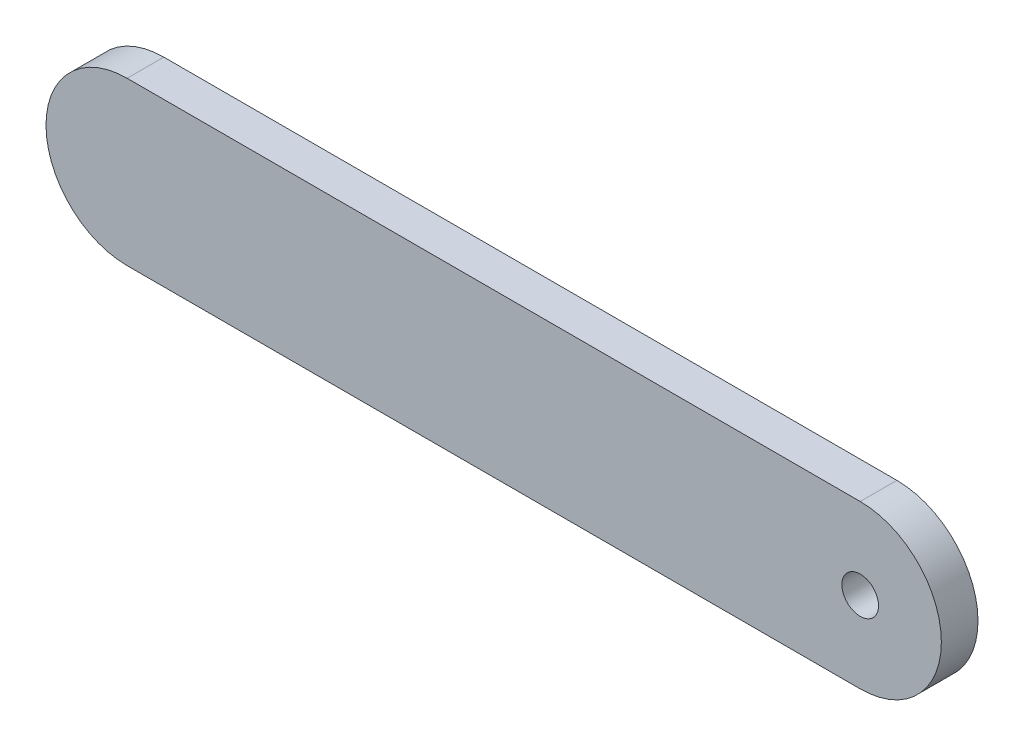
ISO-10303-21;
HEADER;
FILE_DESCRIPTION(('STEP AP214'),'2;1');
FILE_NAME('part.step','',(''),(''),'','','');
FILE_SCHEMA(('AUTOMOTIVE_DESIGN { 1 0 10303 214 1 1 1 1 }'));
ENDSEC;
DATA;
#1=APPLICATION_CONTEXT('core data for automotive mechanical design processes');
#2=APPLICATION_PROTOCOL_DEFINITION('international standard','automotive_design',2000,#1);
#3=PRODUCT_CONTEXT('',#1,'mechanical');
#4=PRODUCT('Part','Part','',(#3));
#5=PRODUCT_RELATED_PRODUCT_CATEGORY('part','',(#4));
#6=PRODUCT_DEFINITION_FORMATION('','',#4);
#7=PRODUCT_DEFINITION_CONTEXT('part definition',#1,'design');
#8=PRODUCT_DEFINITION('design','',#6,#7);
#9=PRODUCT_DEFINITION_SHAPE('','',#8);
#10=(LENGTH_UNIT() NAMED_UNIT(*) SI_UNIT(.MILLI.,.METRE.));
#11=(NAMED_UNIT(*) PLANE_ANGLE_UNIT() SI_UNIT($,.RADIAN.));
#12=(NAMED_UNIT(*) SI_UNIT($,.STERADIAN.) SOLID_ANGLE_UNIT());
#13=UNCERTAINTY_MEASURE_WITH_UNIT(LENGTH_MEASURE(1.E-05),#10,'distance_accuracy_value','');
#14=(GEOMETRIC_REPRESENTATION_CONTEXT(3) GLOBAL_UNCERTAINTY_ASSIGNED_CONTEXT((#13)) GLOBAL_UNIT_ASSIGNED_CONTEXT((#10,
#11,#12)) REPRESENTATION_CONTEXT('',''));
#15=CARTESIAN_POINT('',(0.,0.,0.));
#16=DIRECTION('',(0.,0.,1.));
#17=DIRECTION('',(1.,0.,0.));
#18=AXIS2_PLACEMENT_3D('',#15,#16,#17);
#19=CARTESIAN_POINT('',(-18.3965301196174,0.,3.));
#20=DIRECTION('',(0.,0.,1.));
#21=DIRECTION('',(1.,0.,0.));
#22=AXIS2_PLACEMENT_3D('',#19,#20,#21);
#23=PLANE('',#22);
#24=CARTESIAN_POINT('',(-18.3965301196174,0.,3.));
#25=DIRECTION('',(0.,0.,1.));
#26=DIRECTION('',(1.,0.,0.));
#27=AXIS2_PLACEMENT_3D('',#24,#25,#26);
#28=CIRCLE('',#27,6.64205601656527);
#29=CARTESIAN_POINT('',(-18.3965301196174,6.64205601656527,3.));
#30=VERTEX_POINT('',#29);
#31=CARTESIAN_POINT('',(-18.3965301196174,-6.64205601656527,3.));
#32=VERTEX_POINT('',#31);
#33=EDGE_CURVE('E85',#30,#32,#28,.T.);
#34=ORIENTED_EDGE('',*,*,#33,.T.);
#35=DIRECTION('',(1.,0.,0.));
#36=VECTOR('',#35,1.);
#37=CARTESIAN_POINT('',(-18.3965301196174,-6.64205601656527,3.));
#38=LINE('',#37,#36);
#39=CARTESIAN_POINT('',(41.6034698803826,-6.64205601656527,3.));
#40=VERTEX_POINT('',#39);
#41=EDGE_CURVE('E80',#32,#40,#38,.T.);
#42=ORIENTED_EDGE('',*,*,#41,.T.);
#43=CARTESIAN_POINT('',(41.6034698803826,0.,3.));
#44=DIRECTION('',(0.,0.,1.));
#45=DIRECTION('',(1.,0.,0.));
#46=AXIS2_PLACEMENT_3D('',#43,#44,#45);
#47=CIRCLE('',#46,6.64205601656527);
#48=CARTESIAN_POINT('',(41.6034698803826,6.64205601656527,3.));
#49=VERTEX_POINT('',#48);
#50=EDGE_CURVE('E83',#40,#49,#47,.T.);
#51=ORIENTED_EDGE('',*,*,#50,.T.);
#52=DIRECTION('',(-1.,0.,0.));
#53=VECTOR('',#52,1.);
#54=CARTESIAN_POINT('',(-18.3965301196174,6.64205601656527,3.));
#55=LINE('',#54,#53);
#56=EDGE_CURVE('E50',#49,#30,#55,.T.);
#57=ORIENTED_EDGE('',*,*,#56,.T.);
#58=EDGE_LOOP('',(#34,#42,#51,#57));
#59=FACE_BOUND('',#58,.T.);
#60=CARTESIAN_POINT('',(41.6034698803826,0.,3.));
#61=DIRECTION('',(0.,0.,1.));
#62=DIRECTION('',(1.,0.,0.));
#63=AXIS2_PLACEMENT_3D('',#60,#61,#62);
#64=CIRCLE('',#63,1.5);
#65=CARTESIAN_POINT('',(43.1034698803826,0.,3.));
#66=VERTEX_POINT('',#65);
#67=EDGE_CURVE('E100',#66,#66,#64,.T.);
#68=ORIENTED_EDGE('',*,*,#67,.F.);
#69=EDGE_LOOP('',(#68));
#70=FACE_BOUND('',#69,.T.);
#71=ADVANCED_FACE('F33',(#59,#70),#23,.T.);
#72=CARTESIAN_POINT('',(-18.3965301196174,0.,0.));
#73=DIRECTION('',(0.,0.,1.));
#74=DIRECTION('',(1.,0.,0.));
#75=AXIS2_PLACEMENT_3D('',#72,#73,#74);
#76=PLANE('',#75);
#77=CARTESIAN_POINT('',(-18.3965301196174,0.,0.));
#78=DIRECTION('',(0.,0.,1.));
#79=DIRECTION('',(1.,0.,0.));
#80=AXIS2_PLACEMENT_3D('',#77,#78,#79);
#81=CIRCLE('',#80,6.64205601656527);
#82=CARTESIAN_POINT('',(-18.3965301196174,6.64205601656527,0.));
#83=VERTEX_POINT('',#82);
#84=CARTESIAN_POINT('',(-18.3965301196174,-6.64205601656527,0.));
#85=VERTEX_POINT('',#84);
#86=EDGE_CURVE('E97',#83,#85,#81,.T.);
#87=ORIENTED_EDGE('',*,*,#86,.F.);
#88=DIRECTION('',(-1.,0.,0.));
#89=VECTOR('',#88,1.);
#90=CARTESIAN_POINT('',(-18.3965301196174,6.64205601656527,0.));
#91=LINE('',#90,#89);
#92=CARTESIAN_POINT('',(41.6034698803826,6.64205601656527,0.));
#93=VERTEX_POINT('',#92);
#94=EDGE_CURVE('E73',#93,#83,#91,.T.);
#95=ORIENTED_EDGE('',*,*,#94,.F.);
#96=CARTESIAN_POINT('',(41.6034698803826,0.,0.));
#97=DIRECTION('',(0.,0.,1.));
#98=DIRECTION('',(1.,0.,0.));
#99=AXIS2_PLACEMENT_3D('',#96,#97,#98);
#100=CIRCLE('',#99,6.64205601656527);
#101=CARTESIAN_POINT('',(41.6034698803826,-6.64205601656527,0.));
#102=VERTEX_POINT('',#101);
#103=EDGE_CURVE('E67',#102,#93,#100,.T.);
#104=ORIENTED_EDGE('',*,*,#103,.F.);
#105=DIRECTION('',(1.,0.,0.));
#106=VECTOR('',#105,1.);
#107=CARTESIAN_POINT('',(-18.3965301196174,-6.64205601656527,0.));
#108=LINE('',#107,#106);
#109=EDGE_CURVE('E89',#85,#102,#108,.T.);
#110=ORIENTED_EDGE('',*,*,#109,.F.);
#111=EDGE_LOOP('',(#87,#95,#104,#110));
#112=FACE_BOUND('',#111,.T.);
#113=CARTESIAN_POINT('',(41.6034698803826,0.,0.));
#114=DIRECTION('',(0.,0.,1.));
#115=DIRECTION('',(1.,0.,0.));
#116=AXIS2_PLACEMENT_3D('',#113,#114,#115);
#117=CIRCLE('',#116,1.5);
#118=CARTESIAN_POINT('',(43.1034698803826,0.,0.));
#119=VERTEX_POINT('',#118);
#120=EDGE_CURVE('E112',#119,#119,#117,.T.);
#121=ORIENTED_EDGE('',*,*,#120,.T.);
#122=EDGE_LOOP('',(#121));
#123=FACE_BOUND('',#122,.T.);
#124=ADVANCED_FACE('F108',(#112,#123),#76,.F.);
#125=CARTESIAN_POINT('',(-18.3965301196174,0.,3.));
#126=DIRECTION('',(0.,0.,-1.));
#127=DIRECTION('',(-1.,0.,0.));
#128=AXIS2_PLACEMENT_3D('',#125,#126,#127);
#129=CYLINDRICAL_SURFACE('',#128,6.64205601656527);
#130=ORIENTED_EDGE('',*,*,#86,.T.);
#131=DIRECTION('',(0.,0.,-1.));
#132=VECTOR('',#131,1.);
#133=CARTESIAN_POINT('',(-18.3965301196174,-6.64205601656527,3.));
#134=LINE('',#133,#132);
#135=EDGE_CURVE('E11',#32,#85,#134,.T.);
#136=ORIENTED_EDGE('',*,*,#135,.F.);
#137=ORIENTED_EDGE('',*,*,#33,.F.);
#138=DIRECTION('',(0.,0.,-1.));
#139=VECTOR('',#138,1.);
#140=CARTESIAN_POINT('',(-18.3965301196174,6.64205601656527,3.));
#141=LINE('',#140,#139);
#142=EDGE_CURVE('E93',#30,#83,#141,.T.);
#143=ORIENTED_EDGE('',*,*,#142,.T.);
#144=EDGE_LOOP('',(#130,#136,#137,#143));
#145=FACE_BOUND('',#144,.T.);
#146=ADVANCED_FACE('F35',(#145),#129,.T.);
#147=CARTESIAN_POINT('',(-18.3965301196174,-6.64205601656527,3.));
#148=DIRECTION('',(0.,1.,0.));
#149=DIRECTION('',(0.,0.,1.));
#150=AXIS2_PLACEMENT_3D('',#147,#148,#149);
#151=PLANE('',#150);
#152=ORIENTED_EDGE('',*,*,#109,.T.);
#153=DIRECTION('',(0.,0.,-1.));
#154=VECTOR('',#153,1.);
#155=CARTESIAN_POINT('',(41.6034698803826,-6.64205601656527,3.));
#156=LINE('',#155,#154);
#157=EDGE_CURVE('E42',#40,#102,#156,.T.);
#158=ORIENTED_EDGE('',*,*,#157,.F.);
#159=ORIENTED_EDGE('',*,*,#41,.F.);
#160=ORIENTED_EDGE('',*,*,#135,.T.);
#161=EDGE_LOOP('',(#152,#158,#159,#160));
#162=FACE_BOUND('',#161,.T.);
#163=ADVANCED_FACE('F88',(#162),#151,.F.);
#164=CARTESIAN_POINT('',(41.6034698803826,0.,3.));
#165=DIRECTION('',(0.,0.,-1.));
#166=DIRECTION('',(-1.,0.,0.));
#167=AXIS2_PLACEMENT_3D('',#164,#165,#166);
#168=CYLINDRICAL_SURFACE('',#167,6.64205601656527);
#169=ORIENTED_EDGE('',*,*,#103,.T.);
#170=DIRECTION('',(0.,0.,-1.));
#171=VECTOR('',#170,1.);
#172=CARTESIAN_POINT('',(41.6034698803826,6.64205601656527,3.));
#173=LINE('',#172,#171);
#174=EDGE_CURVE('E90',#49,#93,#173,.T.);
#175=ORIENTED_EDGE('',*,*,#174,.F.);
#176=ORIENTED_EDGE('',*,*,#50,.F.);
#177=ORIENTED_EDGE('',*,*,#157,.T.);
#178=EDGE_LOOP('',(#169,#175,#176,#177));
#179=FACE_BOUND('',#178,.T.);
#180=ADVANCED_FACE('F91',(#179),#168,.T.);
#181=CARTESIAN_POINT('',(-18.3965301196174,6.64205601656527,3.));
#182=DIRECTION('',(0.,-1.,0.));
#183=DIRECTION('',(0.,0.,-1.));
#184=AXIS2_PLACEMENT_3D('',#181,#182,#183);
#185=PLANE('',#184);
#186=ORIENTED_EDGE('',*,*,#94,.T.);
#187=ORIENTED_EDGE('',*,*,#142,.F.);
#188=ORIENTED_EDGE('',*,*,#56,.F.);
#189=ORIENTED_EDGE('',*,*,#174,.T.);
#190=EDGE_LOOP('',(#186,#187,#188,#189));
#191=FACE_BOUND('',#190,.T.);
#192=ADVANCED_FACE('F105',(#191),#185,.F.);
#193=CARTESIAN_POINT('',(41.6034698803826,0.,3.));
#194=DIRECTION('',(0.,0.,-1.));
#195=DIRECTION('',(-1.,0.,0.));
#196=AXIS2_PLACEMENT_3D('',#193,#194,#195);
#197=CYLINDRICAL_SURFACE('',#196,1.5);
#198=ORIENTED_EDGE('',*,*,#67,.T.);
#199=EDGE_LOOP('',(#198));
#200=FACE_BOUND('',#199,.T.);
#201=ORIENTED_EDGE('',*,*,#120,.F.);
#202=EDGE_LOOP('',(#201));
#203=FACE_BOUND('',#202,.T.);
#204=ADVANCED_FACE('F118',(#200,#203),#197,.F.);
#205=CLOSED_SHELL('',(#71,#124,#146,#163,#180,#192,#204));
#206=MANIFOLD_SOLID_BREP('B2',#205);
#207=ADVANCED_BREP_SHAPE_REPRESENTATION('',(#18,#206),#14);
#208=SHAPE_DEFINITION_REPRESENTATION(#9,#207);
ENDSEC;
END-ISO-10303-21;
